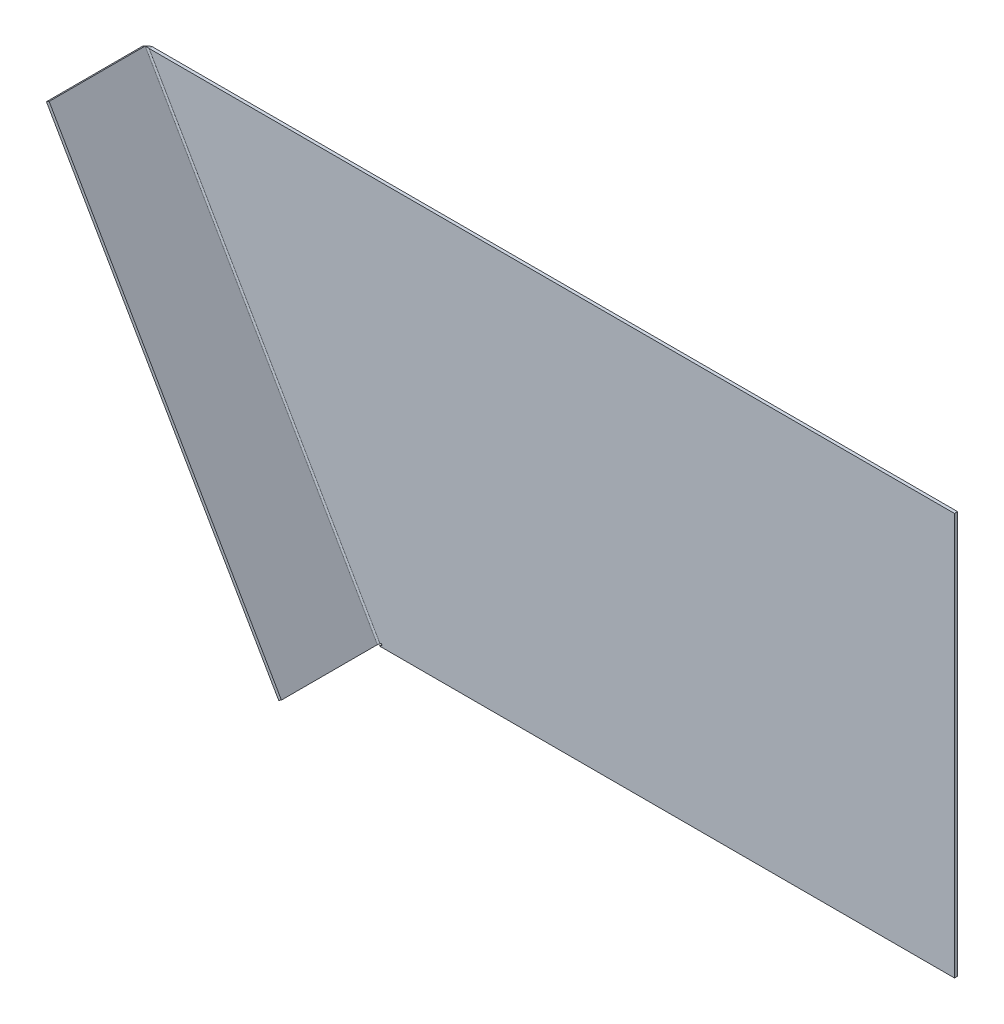
ISO-10303-21;
HEADER;
FILE_DESCRIPTION(('STEP AP214'),'2;1');
FILE_NAME('part.step','',(''),(''),'','','');
FILE_SCHEMA(('AUTOMOTIVE_DESIGN { 1 0 10303 214 1 1 1 1 }'));
ENDSEC;
DATA;
#1=APPLICATION_CONTEXT('core data for automotive mechanical design processes');
#2=APPLICATION_PROTOCOL_DEFINITION('international standard','automotive_design',2000,#1);
#3=PRODUCT_CONTEXT('',#1,'mechanical');
#4=PRODUCT('Part','Part','',(#3));
#5=PRODUCT_RELATED_PRODUCT_CATEGORY('part','',(#4));
#6=PRODUCT_DEFINITION_FORMATION('','',#4);
#7=PRODUCT_DEFINITION_CONTEXT('part definition',#1,'design');
#8=PRODUCT_DEFINITION('design','',#6,#7);
#9=PRODUCT_DEFINITION_SHAPE('','',#8);
#10=(LENGTH_UNIT() NAMED_UNIT(*) SI_UNIT(.MILLI.,.METRE.));
#11=(NAMED_UNIT(*) PLANE_ANGLE_UNIT() SI_UNIT($,.RADIAN.));
#12=(NAMED_UNIT(*) SI_UNIT($,.STERADIAN.) SOLID_ANGLE_UNIT());
#13=UNCERTAINTY_MEASURE_WITH_UNIT(LENGTH_MEASURE(1.E-05),#10,'distance_accuracy_value','');
#14=(GEOMETRIC_REPRESENTATION_CONTEXT(3) GLOBAL_UNCERTAINTY_ASSIGNED_CONTEXT((#13)) GLOBAL_UNIT_ASSIGNED_CONTEXT((#10,
#11,#12)) REPRESENTATION_CONTEXT('',''));
#15=CARTESIAN_POINT('',(0.,0.,0.));
#16=DIRECTION('',(0.,0.,1.));
#17=DIRECTION('',(1.,0.,0.));
#18=AXIS2_PLACEMENT_3D('',#15,#16,#17);
#19=CARTESIAN_POINT('',(0.,203.2,-1.5875));
#20=DIRECTION('',(0.,0.,1.));
#21=DIRECTION('',(1.,0.,0.));
#22=AXIS2_PLACEMENT_3D('',#19,#20,#21);
#23=PLANE('',#22);
#24=DIRECTION('',(-0.866025403784418,-0.500000000000035,0.));
#25=VECTOR('',#24,1.);
#26=CARTESIAN_POINT('',(15.3600560244928,176.595602558476,-1.5875));
#27=LINE('',#26,#25);
#28=CARTESIAN_POINT('',(-289.002987694811,0.871517335746149,-1.58749999999996));
#29=VERTEX_POINT('',#28);
#30=CARTESIAN_POINT('',(-290.5125,0.,-1.58749999999996));
#31=VERTEX_POINT('',#30);
#32=EDGE_CURVE('E72',#29,#31,#27,.T.);
#33=ORIENTED_EDGE('',*,*,#32,.F.);
#34=DIRECTION('',(0.500000000000017,-0.866025403784429,0.));
#35=VECTOR('',#34,1.);
#36=CARTESIAN_POINT('',(-304.363043719307,27.4759147772764,-1.58749999999996));
#37=LINE('',#36,#35);
#38=CARTESIAN_POINT('',(-289.399862694811,1.55892500000005,-1.58749999999996));
#39=VERTEX_POINT('',#38);
#40=EDGE_CURVE('E105',#39,#29,#37,.T.);
#41=ORIENTED_EDGE('',*,*,#40,.F.);
#42=DIRECTION('',(0.866025403784441,0.499999999999996,0.));
#43=VECTOR('',#42,1.);
#44=CARTESIAN_POINT('',(14.9631810244996,177.283010222716,-1.5875));
#45=LINE('',#44,#43);
#46=CARTESIAN_POINT('',(-290.087270359063,1.16205000000078,-1.58750000000075));
#47=VERTEX_POINT('',#46);
#48=EDGE_CURVE('E119',#47,#39,#45,.T.);
#49=ORIENTED_EDGE('',*,*,#48,.F.);
#50=DIRECTION('',(0.499999999999993,-0.866025403784442,0.));
#51=VECTOR('',#50,1.);
#52=CARTESIAN_POINT('',(-290.087270359063,1.16205000000082,-1.58750000000075));
#53=LINE('',#52,#51);
#54=CARTESIAN_POINT('',(-406.733935178083,203.200000000001,-1.5875));
#55=VERTEX_POINT('',#54);
#56=EDGE_CURVE('E275',#47,#55,#53,.F.);
#57=ORIENTED_EDGE('',*,*,#56,.T.);
#58=DIRECTION('',(-1.,0.,0.));
#59=VECTOR('',#58,1.);
#60=CARTESIAN_POINT('',(0.,203.2,-1.5875));
#61=LINE('',#60,#59);
#62=CARTESIAN_POINT('',(0.,203.2,-1.5875));
#63=VERTEX_POINT('',#62);
#64=EDGE_CURVE('E95',#63,#55,#61,.T.);
#65=ORIENTED_EDGE('',*,*,#64,.F.);
#66=DIRECTION('',(0.,-1.,0.));
#67=VECTOR('',#66,1.);
#68=CARTESIAN_POINT('',(0.,203.2,-1.5875));
#69=LINE('',#68,#67);
#70=CARTESIAN_POINT('',(0.,0.,-1.5875));
#71=VERTEX_POINT('',#70);
#72=EDGE_CURVE('E65',#63,#71,#69,.T.);
#73=ORIENTED_EDGE('',*,*,#72,.T.);
#74=DIRECTION('',(-1.,0.,0.));
#75=VECTOR('',#74,1.);
#76=CARTESIAN_POINT('',(0.,0.,-1.5875));
#77=LINE('',#76,#75);
#78=EDGE_CURVE('E92',#71,#31,#77,.T.);
#79=ORIENTED_EDGE('',*,*,#78,.T.);
#80=EDGE_LOOP('',(#33,#41,#49,#57,#65,#73,#79));
#81=FACE_BOUND('',#80,.T.);
#82=ADVANCED_FACE('F58',(#81),#23,.F.);
#83=CARTESIAN_POINT('',(0.,203.2,0.));
#84=DIRECTION('',(0.,0.,1.));
#85=DIRECTION('',(1.,0.,0.));
#86=AXIS2_PLACEMENT_3D('',#83,#84,#85);
#87=PLANE('',#86);
#88=DIRECTION('',(-0.500000000000017,0.866025403784429,0.));
#89=VECTOR('',#88,1.);
#90=CARTESIAN_POINT('',(-289.002987694811,0.871517335746138,-7.44725879205654E-13));
#91=LINE('',#90,#89);
#92=CARTESIAN_POINT('',(-289.002987694811,0.871517335746138,-7.44725879205654E-13));
#93=VERTEX_POINT('',#92);
#94=CARTESIAN_POINT('',(-289.399862694811,1.55892500000004,-7.44846892497542E-13));
#95=VERTEX_POINT('',#94);
#96=EDGE_CURVE('E125',#93,#95,#91,.T.);
#97=ORIENTED_EDGE('',*,*,#96,.F.);
#98=DIRECTION('',(0.866025403784418,0.500000000000035,-2.23834732691071E-13));
#99=VECTOR('',#98,1.);
#100=CARTESIAN_POINT('',(-290.5125,0.,-3.54574179440962E-13));
#101=LINE('',#100,#99);
#102=CARTESIAN_POINT('',(-290.5125,0.,-3.54574179440962E-13));
#103=VERTEX_POINT('',#102);
#104=EDGE_CURVE('E123',#103,#93,#101,.T.);
#105=ORIENTED_EDGE('',*,*,#104,.F.);
#106=DIRECTION('',(-1.,0.,0.));
#107=VECTOR('',#106,1.);
#108=CARTESIAN_POINT('',(0.,0.,0.));
#109=LINE('',#108,#107);
#110=CARTESIAN_POINT('',(0.,0.,0.));
#111=VERTEX_POINT('',#110);
#112=EDGE_CURVE('E104',#111,#103,#109,.T.);
#113=ORIENTED_EDGE('',*,*,#112,.F.);
#114=DIRECTION('',(0.,-1.,0.));
#115=VECTOR('',#114,1.);
#116=CARTESIAN_POINT('',(0.,203.2,0.));
#117=LINE('',#116,#115);
#118=CARTESIAN_POINT('',(0.,203.2,0.));
#119=VERTEX_POINT('',#118);
#120=EDGE_CURVE('E13',#119,#111,#117,.T.);
#121=ORIENTED_EDGE('',*,*,#120,.F.);
#122=DIRECTION('',(-1.,0.,0.));
#123=VECTOR('',#122,1.);
#124=CARTESIAN_POINT('',(0.,203.2,0.));
#125=LINE('',#124,#123);
#126=CARTESIAN_POINT('',(-406.733935178083,203.200000000001,-7.44792682388917E-13));
#127=VERTEX_POINT('',#126);
#128=EDGE_CURVE('E110',#119,#127,#125,.T.);
#129=ORIENTED_EDGE('',*,*,#128,.T.);
#130=DIRECTION('',(0.499999999999993,-0.866025403784442,0.));
#131=VECTOR('',#130,1.);
#132=CARTESIAN_POINT('',(-290.087270359065,1.16205000000006,-7.44846892497542E-13));
#133=LINE('',#132,#131);
#134=CARTESIAN_POINT('',(-290.087270359065,1.16205000000004,-7.44846892497542E-13));
#135=VERTEX_POINT('',#134);
#136=EDGE_CURVE('E148',#135,#127,#133,.F.);
#137=ORIENTED_EDGE('',*,*,#136,.F.);
#138=DIRECTION('',(-0.866025403784441,-0.499999999999996,0.));
#139=VECTOR('',#138,1.);
#140=CARTESIAN_POINT('',(-289.399862694811,1.55892500000004,-7.44846892497542E-13));
#141=LINE('',#140,#139);
#142=EDGE_CURVE('E128',#95,#135,#141,.T.);
#143=ORIENTED_EDGE('',*,*,#142,.F.);
#144=EDGE_LOOP('',(#97,#105,#113,#121,#129,#137,#143));
#145=FACE_BOUND('',#144,.T.);
#146=ADVANCED_FACE('F193',(#145),#87,.T.);
#147=CARTESIAN_POINT('',(0.,203.2,0.));
#148=DIRECTION('',(0.,-1.,0.));
#149=DIRECTION('',(-1.,0.,0.));
#150=AXIS2_PLACEMENT_3D('',#147,#148,#149);
#151=PLANE('',#150);
#152=DIRECTION('',(8.41999693620532E-13,4.86128749769388E-13,-1.));
#153=VECTOR('',#152,1.);
#154=CARTESIAN_POINT('',(-406.733935178083,203.200000000001,-7.44846892497542E-13));
#155=LINE('',#154,#153);
#156=EDGE_CURVE('E132',#127,#55,#155,.T.);
#157=ORIENTED_EDGE('',*,*,#156,.F.);
#158=ORIENTED_EDGE('',*,*,#128,.F.);
#159=DIRECTION('',(0.,0.,1.));
#160=VECTOR('',#159,1.);
#161=CARTESIAN_POINT('',(0.,203.2,-1.5875));
#162=LINE('',#161,#160);
#163=EDGE_CURVE('E97',#63,#119,#162,.T.);
#164=ORIENTED_EDGE('',*,*,#163,.F.);
#165=ORIENTED_EDGE('',*,*,#64,.T.);
#166=EDGE_LOOP('',(#157,#158,#164,#165));
#167=FACE_BOUND('',#166,.T.);
#168=ADVANCED_FACE('F197',(#167),#151,.F.);
#169=CARTESIAN_POINT('',(0.,0.,0.));
#170=DIRECTION('',(0.,-1.,0.));
#171=DIRECTION('',(-1.,0.,0.));
#172=AXIS2_PLACEMENT_3D('',#169,#170,#171);
#173=PLANE('',#172);
#174=ORIENTED_EDGE('',*,*,#112,.T.);
#175=DIRECTION('',(0.,0.,-1.));
#176=VECTOR('',#175,1.);
#177=CARTESIAN_POINT('',(-290.5125,0.,-3.54574179440962E-13));
#178=LINE('',#177,#176);
#179=EDGE_CURVE('E103',#103,#31,#178,.T.);
#180=ORIENTED_EDGE('',*,*,#179,.T.);
#181=ORIENTED_EDGE('',*,*,#78,.F.);
#182=DIRECTION('',(0.,0.,1.));
#183=VECTOR('',#182,1.);
#184=CARTESIAN_POINT('',(0.,0.,-1.5875));
#185=LINE('',#184,#183);
#186=EDGE_CURVE('E102',#71,#111,#185,.T.);
#187=ORIENTED_EDGE('',*,*,#186,.T.);
#188=EDGE_LOOP('',(#174,#180,#181,#187));
#189=FACE_BOUND('',#188,.T.);
#190=ADVANCED_FACE('F101',(#189),#173,.T.);
#191=CARTESIAN_POINT('',(0.,203.2,-1.5875));
#192=DIRECTION('',(1.,0.,0.));
#193=DIRECTION('',(0.,0.,-1.));
#194=AXIS2_PLACEMENT_3D('',#191,#192,#193);
#195=PLANE('',#194);
#196=ORIENTED_EDGE('',*,*,#186,.F.);
#197=ORIENTED_EDGE('',*,*,#72,.F.);
#198=ORIENTED_EDGE('',*,*,#163,.T.);
#199=ORIENTED_EDGE('',*,*,#120,.T.);
#200=EDGE_LOOP('',(#196,#197,#198,#199));
#201=FACE_BOUND('',#200,.T.);
#202=ADVANCED_FACE('F107',(#201),#195,.T.);
#203=CARTESIAN_POINT('',(-289.002987694811,0.871517335746138,-7.44725879205654E-13));
#204=DIRECTION('',(-0.866025403784429,-0.500000000000017,0.));
#205=DIRECTION('',(0.500000000000017,-0.866025403784429,0.));
#206=AXIS2_PLACEMENT_3D('',#203,#204,#205);
#207=PLANE('',#206);
#208=DIRECTION('',(0.,0.,-1.));
#209=VECTOR('',#208,1.);
#210=CARTESIAN_POINT('',(-289.399862694811,1.55892500000004,-7.44846892497542E-13));
#211=LINE('',#210,#209);
#212=EDGE_CURVE('E129',#95,#39,#211,.T.);
#213=ORIENTED_EDGE('',*,*,#212,.T.);
#214=ORIENTED_EDGE('',*,*,#40,.T.);
#215=DIRECTION('',(0.,0.,-1.));
#216=VECTOR('',#215,1.);
#217=CARTESIAN_POINT('',(-289.002987694811,0.871517335746138,-7.44725879205654E-13));
#218=LINE('',#217,#216);
#219=EDGE_CURVE('E126',#93,#29,#218,.T.);
#220=ORIENTED_EDGE('',*,*,#219,.F.);
#221=ORIENTED_EDGE('',*,*,#96,.T.);
#222=EDGE_LOOP('',(#213,#214,#220,#221));
#223=FACE_BOUND('',#222,.T.);
#224=ADVANCED_FACE('F208',(#223),#207,.T.);
#225=CARTESIAN_POINT('',(-289.399862694811,1.55892500000004,-7.44846892497542E-13));
#226=DIRECTION('',(0.499999999999996,-0.866025403784441,0.));
#227=DIRECTION('',(0.866025403784441,0.499999999999996,0.));
#228=AXIS2_PLACEMENT_3D('',#225,#226,#227);
#229=PLANE('',#228);
#230=DIRECTION('',(8.08857401698927E-13,4.66994038606888E-13,-1.));
#231=VECTOR('',#230,1.);
#232=CARTESIAN_POINT('',(-290.087270359065,1.16205000000004,-7.44846892497542E-13));
#233=LINE('',#232,#231);
#234=EDGE_CURVE('E238',#135,#47,#233,.T.);
#235=ORIENTED_EDGE('',*,*,#234,.T.);
#236=ORIENTED_EDGE('',*,*,#48,.T.);
#237=ORIENTED_EDGE('',*,*,#212,.F.);
#238=ORIENTED_EDGE('',*,*,#142,.T.);
#239=EDGE_LOOP('',(#235,#236,#237,#238));
#240=FACE_BOUND('',#239,.T.);
#241=ADVANCED_FACE('F214',(#240),#229,.T.);
#242=CARTESIAN_POINT('',(-290.5125,0.,-3.54574179440962E-13));
#243=DIRECTION('',(-0.500000000000035,0.866025403784418,0.));
#244=DIRECTION('',(-0.866025403784418,-0.500000000000035,0.));
#245=AXIS2_PLACEMENT_3D('',#242,#243,#244);
#246=PLANE('',#245);
#247=ORIENTED_EDGE('',*,*,#219,.T.);
#248=ORIENTED_EDGE('',*,*,#32,.T.);
#249=ORIENTED_EDGE('',*,*,#179,.F.);
#250=ORIENTED_EDGE('',*,*,#104,.T.);
#251=EDGE_LOOP('',(#247,#248,#249,#250));
#252=FACE_BOUND('',#251,.T.);
#253=ADVANCED_FACE('F211',(#252),#246,.T.);
#254=CARTESIAN_POINT('',(-406.733935178085,203.199999999999,-1.60337500000074));
#255=CARTESIAN_POINT('',(-407.055160786998,203.143677589455,-1.60337500000049));
#256=CARTESIAN_POINT('',(-407.376179766809,203.087433247148,-1.5424717140872));
#257=CARTESIAN_POINT('',(-407.978144485325,202.998122088203,-1.30803830408921));
#258=CARTESIAN_POINT('',(-408.258846243088,202.965175519463,-1.13460041954051));
#259=CARTESIAN_POINT('',(-408.745806373827,202.942262290229,-0.701423961073045));
#260=CARTESIAN_POINT('',(-408.951917144518,202.952380847955,-0.441855823593198));
#261=CARTESIAN_POINT('',(-409.266760746457,203.028839142956,0.124116494296507));
#262=CARTESIAN_POINT('',(-409.375404769555,203.095209539076,0.430249257063361));
#263=CARTESIAN_POINT('',(-409.431322852617,203.1920625,0.73659999999997));
#264=CARTESIAN_POINT('',(-406.733935178085,203.199999999999,-1.58750000000074));
#265=CARTESIAN_POINT('',(-407.053360757843,203.144716730962,-1.58750000000049));
#266=CARTESIAN_POINT('',(-407.372581216773,203.08951087098,-1.5270098978451));
#267=CARTESIAN_POINT('',(-407.971220654386,203.00211956386,-1.29416694517409));
#268=CARTESIAN_POINT('',(-408.250397360581,202.970053484053,-1.12190570841744));
#269=CARTESIAN_POINT('',(-408.734812431501,202.948609645791,-0.691668031893448));
#270=CARTESIAN_POINT('',(-408.939904195312,202.959316527413,-0.433860872279814));
#271=CARTESIAN_POINT('',(-409.253370420802,203.036570051077,0.128271741960709));
#272=CARTESIAN_POINT('',(-409.361656662087,203.103147118434,0.432327698792667));
#273=CARTESIAN_POINT('',(-409.417574699332,203.2,0.73659999999997));
#274=CARTESIAN_POINT('',(-406.733935178084,203.2,-7.44846892497542E-13));
#275=CARTESIAN_POINT('',(-406.873357842336,203.248630881658,-6.61275692962625E-13));
#276=CARTESIAN_POINT('',(-407.01272621315,203.29727325419,0.0191717263655383));
#277=CARTESIAN_POINT('',(-407.278837560444,203.401867129529,0.0929689463378204));
#278=CARTESIAN_POINT('',(-407.405509109875,203.457849943033,0.147565403889134));
#279=CARTESIAN_POINT('',(-407.635418198872,203.583345201945,0.283924886066228));
#280=CARTESIAN_POINT('',(-407.738609274761,203.652884473169,0.365634259058597));
#281=CARTESIAN_POINT('',(-407.914337855371,203.809660863183,0.543796508380848));
#282=CARTESIAN_POINT('',(-407.986845915298,203.896905054203,0.640171871723308));
#283=CARTESIAN_POINT('',(-408.042759370824,203.99375,0.736599999999976));
#284=CARTESIAN_POINT('',(-406.733935178084,203.2,0.0160337499992552));
#285=CARTESIAN_POINT('',(-406.87153981289,203.24968041458,0.016033749999337));
#286=CARTESIAN_POINT('',(-407.009091677613,203.299371654261,0.0347881607700657));
#287=CARTESIAN_POINT('',(-407.271844491195,203.405904579943,0.106979018842091));
#288=CARTESIAN_POINT('',(-407.396975738543,203.462776687269,0.16038706212343));
#289=CARTESIAN_POINT('',(-407.624314317123,203.589756031062,0.293778374537621));
#290=CARTESIAN_POINT('',(-407.726476196063,203.659889509421,0.373709159885115));
#291=CARTESIAN_POINT('',(-407.90081362646,203.817469080385,0.547993308521691));
#292=CARTESIAN_POINT('',(-407.972960326756,203.904922009355,0.642271097869908));
#293=CARTESIAN_POINT('',(-408.028873736006,204.001766875,0.736599999999976));
#294=B_SPLINE_SURFACE_WITH_KNOTS('',1,3,((#254,#255,#256,#257,#258,#259,#260,#261,#262,#263),
(#264,#265,#266,#267,#268,#269,#270,#271,#272,#273),(#274,#275,#276,#277,#278,#279,#280,#281,
#282,#283),(#284,#285,#286,#287,#288,#289,#290,#291,#292,#293)),.UNSPECIFIED.,.F.,.F.,.F.,(2,1,
1,2),(4,2,2,2,4),(-0.01,0.,1.,1.0101),(0.,0.25,0.5,0.75,1.),.UNSPECIFIED.);
#295=DIRECTION('',(0.86602540378444,0.499999999999998,0.));
#296=VECTOR('',#295,1.);
#297=CARTESIAN_POINT('',(-409.417574699331,203.2,0.736599999999971));
#298=LINE('',#297,#296);
#299=CARTESIAN_POINT('',(-408.042759370824,203.99375,0.736599999999976));
#300=VERTEX_POINT('',#299);
#301=CARTESIAN_POINT('',(-409.417574699331,203.2,0.73659999999997));
#302=VERTEX_POINT('',#301);
#303=EDGE_CURVE('E272',#300,#302,#298,.F.);
#304=CARTESIAN_POINT('',(-406.733935178084,203.2,-7.44846892497542E-13));
#305=CARTESIAN_POINT('',(-406.779950355948,203.216051768068,-1.20620819126919E-05));
#306=CARTESIAN_POINT('',(-406.825962929327,203.232101745282,0.00206203282202842));
#307=CARTESIAN_POINT('',(-406.917522210535,203.264464705255,0.0102944682398531));
#308=CARTESIAN_POINT('',(-406.96306897119,203.280777657638,0.0164523402955853));
#309=CARTESIAN_POINT('',(-407.053083179884,203.313876573826,0.0327347142828491));
#310=CARTESIAN_POINT('',(-407.097553943701,203.330660607194,0.0428447467124444));
#311=CARTESIAN_POINT('',(-407.185141128822,203.364998440555,0.0668507162235848));
#312=CARTESIAN_POINT('',(-407.228257590413,203.382552217614,0.0807465405664543));
#313=CARTESIAN_POINT('',(-407.355326307256,203.436893958266,0.127932147308252));
#314=CARTESIAN_POINT('',(-407.436670113296,203.47524759329,0.166659125037459));
#315=CARTESIAN_POINT('',(-407.589253679417,203.557794559769,0.255989917751154));
#316=CARTESIAN_POINT('',(-407.660492573263,203.601988391244,0.306594749966843));
#317=CARTESIAN_POINT('',(-407.758937173654,203.674254740512,0.389551810225545));
#318=CARTESIAN_POINT('',(-407.790728367214,203.699736270814,0.418836509135844));
#319=CARTESIAN_POINT('',(-407.850838826576,203.752718101012,0.479119589976424));
#320=CARTESIAN_POINT('',(-407.87915786565,203.780218532552,0.510118083623349));
#321=CARTESIAN_POINT('',(-407.932242219039,203.837440106413,0.573398512480383));
#322=CARTESIAN_POINT('',(-407.956993025624,203.867169606668,0.605685041510468));
#323=CARTESIAN_POINT('',(-408.002725347162,203.928810375527,0.670847076336169));
#324=CARTESIAN_POINT('',(-408.023706477032,203.960721866568,0.703722641926538));
#325=CARTESIAN_POINT('',(-408.042759370824,203.99375,0.736599999999976));
#326=B_SPLINE_CURVE_WITH_KNOTS('',3,(#304,#305,#306,#307,#308,#309,#310,#311,#312,#313,#314,
#315,#316,#317,#318,#319,#320,#321,#322,#323,#324,#325),.UNSPECIFIED.,.F.,.F.,(4,2,2,2,2,2,2,2,
2,2,4),(0.,0.146154486814233,0.292292210857646,0.437899837716808,0.583503128939626,
0.875753899910738,1.16802970866484,1.31839529007632,1.46877068490931,1.61974120375091,
1.77072713585112),.UNSPECIFIED.);
#327=EDGE_CURVE('E139',#127,#300,#326,.T.);
#328=CARTESIAN_POINT('',(-406.733935178085,203.199999999999,-1.58750000000074));
#329=CARTESIAN_POINT('',(-406.800743737861,203.188438728209,-1.58750081267307));
#330=CARTESIAN_POINT('',(-406.867527051428,203.176881101307,-1.58488494414637));
#331=CARTESIAN_POINT('',(-407.000715441418,203.153980376642,-1.57444916273615));
#332=CARTESIAN_POINT('',(-407.0671205573,203.1426372562,-1.56662980317947));
#333=CARTESIAN_POINT('',(-407.265196965277,203.109253831985,-1.53542560375361));
#334=CARTESIAN_POINT('',(-407.39583292267,203.087841074411,-1.50429454907179));
#335=CARTESIAN_POINT('',(-407.663309749968,203.04653926441,-1.41831193683393));
#336=CARTESIAN_POINT('',(-407.799569939282,203.026985553896,-1.36149638207346));
#337=CARTESIAN_POINT('',(-408.061498775213,202.993981564598,-1.22593479742267));
#338=CARTESIAN_POINT('',(-408.187168316412,202.980530769883,-1.1471906222503));
#339=CARTESIAN_POINT('',(-408.424697011456,202.961608039581,-0.970315529126827));
#340=CARTESIAN_POINT('',(-408.536556707066,202.956135790901,-0.87218537209007));
#341=CARTESIAN_POINT('',(-408.743722486122,202.954761083269,-0.659655068917461));
#342=CARTESIAN_POINT('',(-408.839023387016,202.958861614618,-0.545249849335332));
#343=CARTESIAN_POINT('',(-409.010812749436,202.977946004141,-0.303864199472295));
#344=CARTESIAN_POINT('',(-409.087293698265,202.992934199134,-0.176878775605333));
#345=CARTESIAN_POINT('',(-409.219698368275,203.034741738043,0.0854873652663903));
#346=CARTESIAN_POINT('',(-409.275644854693,203.06154790709,0.220858589609468));
#347=CARTESIAN_POINT('',(-409.341448481761,203.109524529636,0.420714632006021));
#348=CARTESIAN_POINT('',(-409.35982139892,203.125827506876,0.483699153655391));
#349=CARTESIAN_POINT('',(-409.392060737075,203.160988708677,0.609979755719965));
#350=CARTESIAN_POINT('',(-409.405935060962,203.179842368813,0.673275089282185));
#351=CARTESIAN_POINT('',(-409.417574699332,203.2,0.73659999999997));
#352=B_SPLINE_CURVE_WITH_KNOTS('',3,(#328,#329,#330,#331,#332,#333,#334,#335,#336,#337,#338,
#339,#340,#341,#342,#343,#344,#345,#346,#347,#348,#349,#350,#351),.UNSPECIFIED.,.F.,.F.,(4,2,2,
2,2,2,2,2,2,2,2,4),(0.,0.203303503959263,0.40658539256198,0.812836886622702,1.25748866275538,
1.70210284175395,2.14669957277803,2.591435203462,3.03634808026109,3.48076621021634,
3.68341341554135,3.88570266741171),.UNSPECIFIED.);
#353=EDGE_CURVE('E149',#55,#302,#352,.T.);
#354=ORIENTED_EDGE('',*,*,#303,.F.);
#355=ORIENTED_EDGE('',*,*,#327,.F.);
#356=ORIENTED_EDGE('',*,*,#156,.T.);
#357=ORIENTED_EDGE('',*,*,#353,.T.);
#358=EDGE_LOOP('',(#354,#355,#356,#357));
#359=FACE_BOUND('',#358,.T.);
#360=ADVANCED_FACE('F155',(#359),#294,.F.);
#361=CARTESIAN_POINT('',(-290.087270359065,1.16204999999968,0.736599999999978));
#362=DIRECTION('',(-0.499999999999993,0.866025403784442,0.));
#363=DIRECTION('',(-0.866025403784443,-0.499999999999993,0.));
#364=AXIS2_PLACEMENT_3D('',#361,#362,#363);
#365=PLANE('',#364);
#366=CARTESIAN_POINT('',(-290.087270359065,1.16204999999968,0.736599999999978));
#367=DIRECTION('',(0.499999999999993,-0.866025403784442,0.));
#368=DIRECTION('',(0.866025403784443,0.499999999999993,0.));
#369=AXIS2_PLACEMENT_3D('',#366,#367,#368);
#370=CIRCLE('',#369,0.736600000000723);
#371=CARTESIAN_POINT('',(-290.725184671493,0.793749999999323,0.736599999999976));
#372=VERTEX_POINT('',#371);
#373=EDGE_CURVE('E231',#372,#135,#370,.T.);
#374=ORIENTED_EDGE('',*,*,#373,.F.);
#375=DIRECTION('',(0.86602540378444,0.499999999999998,0.));
#376=VECTOR('',#375,1.);
#377=CARTESIAN_POINT('',(-290.725184671492,0.793750000000065,0.736599999999976));
#378=LINE('',#377,#376);
#379=CARTESIAN_POINT('',(-292.1,0.,0.736599999999971));
#380=VERTEX_POINT('',#379);
#381=EDGE_CURVE('E235',#372,#380,#378,.F.);
#382=ORIENTED_EDGE('',*,*,#381,.T.);
#383=CARTESIAN_POINT('',(-290.087270359065,1.1620499999997,0.736599999999978));
#384=DIRECTION('',(0.499999999999993,-0.866025403784442,0.));
#385=DIRECTION('',(0.866025403784443,0.499999999999993,0.));
#386=AXIS2_PLACEMENT_3D('',#383,#384,#385);
#387=CIRCLE('',#386,2.32410000000072);
#388=EDGE_CURVE('E147',#380,#47,#387,.T.);
#389=ORIENTED_EDGE('',*,*,#388,.T.);
#390=ORIENTED_EDGE('',*,*,#234,.F.);
#391=EDGE_LOOP('',(#374,#382,#389,#390));
#392=FACE_BOUND('',#391,.T.);
#393=ADVANCED_FACE('F169',(#392),#365,.F.);
#394=CARTESIAN_POINT('',(-290.087270359065,1.16204999999972,0.736599999999978));
#395=DIRECTION('',(0.499999999999993,-0.866025403784442,0.));
#396=DIRECTION('',(-0.866025403784443,-0.499999999999993,0.));
#397=AXIS2_PLACEMENT_3D('',#394,#395,#396);
#398=CYLINDRICAL_SURFACE('',#397,2.32410000000072);
#399=ORIENTED_EDGE('',*,*,#56,.F.);
#400=ORIENTED_EDGE('',*,*,#388,.F.);
#401=DIRECTION('',(0.499999999999998,-0.86602540378444,0.));
#402=VECTOR('',#401,1.);
#403=CARTESIAN_POINT('',(-409.417574699331,203.2,0.736599999999971));
#404=LINE('',#403,#402);
#405=EDGE_CURVE('E255',#380,#302,#404,.F.);
#406=ORIENTED_EDGE('',*,*,#405,.T.);
#407=ORIENTED_EDGE('',*,*,#353,.F.);
#408=EDGE_LOOP('',(#399,#400,#406,#407));
#409=FACE_BOUND('',#408,.T.);
#410=ADVANCED_FACE('F164',(#409),#398,.T.);
#411=CARTESIAN_POINT('',(-290.087270359065,1.16204999999972,0.736599999999978));
#412=DIRECTION('',(0.499999999999993,-0.866025403784442,0.));
#413=DIRECTION('',(-0.866025403784443,-0.499999999999993,0.));
#414=AXIS2_PLACEMENT_3D('',#411,#412,#413);
#415=CYLINDRICAL_SURFACE('',#414,0.736600000000723);
#416=ORIENTED_EDGE('',*,*,#136,.T.);
#417=ORIENTED_EDGE('',*,*,#327,.T.);
#418=DIRECTION('',(0.499999999999998,-0.86602540378444,0.));
#419=VECTOR('',#418,1.);
#420=CARTESIAN_POINT('',(-408.042759370824,203.99375,0.736599999999976));
#421=LINE('',#420,#419);
#422=EDGE_CURVE('E256',#300,#372,#421,.T.);
#423=ORIENTED_EDGE('',*,*,#422,.T.);
#424=ORIENTED_EDGE('',*,*,#373,.T.);
#425=EDGE_LOOP('',(#416,#417,#423,#424));
#426=FACE_BOUND('',#425,.T.);
#427=ADVANCED_FACE('F160',(#426),#415,.F.);
#428=CARTESIAN_POINT('',(-292.1,0.,49.2125));
#429=DIRECTION('',(-0.499999999999998,0.86602540378444,0.));
#430=DIRECTION('',(-0.86602540378444,-0.499999999999998,0.));
#431=AXIS2_PLACEMENT_3D('',#428,#429,#430);
#432=PLANE('',#431);
#433=ORIENTED_EDGE('',*,*,#381,.F.);
#434=DIRECTION('',(0.,0.,-1.));
#435=VECTOR('',#434,1.);
#436=CARTESIAN_POINT('',(-290.725184671492,0.793749999999896,49.2125));
#437=LINE('',#436,#435);
#438=CARTESIAN_POINT('',(-290.725184671492,0.793749999999893,49.2125));
#439=VERTEX_POINT('',#438);
#440=EDGE_CURVE('E251',#372,#439,#437,.F.);
#441=ORIENTED_EDGE('',*,*,#440,.T.);
#442=DIRECTION('',(0.86602540378444,0.499999999999998,0.));
#443=VECTOR('',#442,1.);
#444=CARTESIAN_POINT('',(-292.1,0.,49.2125));
#445=LINE('',#444,#443);
#446=CARTESIAN_POINT('',(-292.1,0.,49.2125));
#447=VERTEX_POINT('',#446);
#448=EDGE_CURVE('E244',#447,#439,#445,.T.);
#449=ORIENTED_EDGE('',*,*,#448,.F.);
#450=DIRECTION('',(0.,0.,1.));
#451=VECTOR('',#450,1.);
#452=CARTESIAN_POINT('',(-292.1,0.,-6.64513812209377E-13));
#453=LINE('',#452,#451);
#454=EDGE_CURVE('E254',#380,#447,#453,.T.);
#455=ORIENTED_EDGE('',*,*,#454,.F.);
#456=EDGE_LOOP('',(#433,#441,#449,#455));
#457=FACE_BOUND('',#456,.T.);
#458=ADVANCED_FACE('F163',(#457),#432,.F.);
#459=CARTESIAN_POINT('',(-409.417574699331,203.2,0.));
#460=DIRECTION('',(0.499999999999998,-0.86602540378444,0.));
#461=DIRECTION('',(0.86602540378444,0.499999999999998,0.));
#462=AXIS2_PLACEMENT_3D('',#459,#460,#461);
#463=PLANE('',#462);
#464=ORIENTED_EDGE('',*,*,#303,.T.);
#465=DIRECTION('',(0.,0.,-1.));
#466=VECTOR('',#465,1.);
#467=CARTESIAN_POINT('',(-409.417574699331,203.2,-9.13979447875789E-13));
#468=LINE('',#467,#466);
#469=CARTESIAN_POINT('',(-409.417574699332,203.2,49.2125));
#470=VERTEX_POINT('',#469);
#471=EDGE_CURVE('E298',#470,#302,#468,.T.);
#472=ORIENTED_EDGE('',*,*,#471,.F.);
#473=DIRECTION('',(0.86602540378444,0.499999999999998,0.));
#474=VECTOR('',#473,1.);
#475=CARTESIAN_POINT('',(-409.417574699332,203.2,49.2125));
#476=LINE('',#475,#474);
#477=CARTESIAN_POINT('',(-408.042759370824,203.99375,49.2125));
#478=VERTEX_POINT('',#477);
#479=EDGE_CURVE('E328',#470,#478,#476,.T.);
#480=ORIENTED_EDGE('',*,*,#479,.T.);
#481=DIRECTION('',(0.,0.,1.));
#482=VECTOR('',#481,1.);
#483=CARTESIAN_POINT('',(-408.042759370824,203.99375,0.));
#484=LINE('',#483,#482);
#485=EDGE_CURVE('E265',#478,#300,#484,.F.);
#486=ORIENTED_EDGE('',*,*,#485,.T.);
#487=EDGE_LOOP('',(#464,#472,#480,#486));
#488=FACE_BOUND('',#487,.T.);
#489=ADVANCED_FACE('F173',(#488),#463,.F.);
#490=CARTESIAN_POINT('',(-219.075000000001,-126.483010222717,-8.56449603610338E-13));
#491=DIRECTION('',(0.86602540378444,0.499999999999998,0.));
#492=DIRECTION('',(-0.499999999999998,0.86602540378444,0.));
#493=AXIS2_PLACEMENT_3D('',#490,#491,#492);
#494=PLANE('',#493);
#495=ORIENTED_EDGE('',*,*,#405,.F.);
#496=ORIENTED_EDGE('',*,*,#454,.T.);
#497=DIRECTION('',(-0.499999999999998,0.86602540378444,0.));
#498=VECTOR('',#497,1.);
#499=CARTESIAN_POINT('',(-219.075000000001,-126.483010222717,49.2125000000001));
#500=LINE('',#499,#498);
#501=EDGE_CURVE('E324',#447,#470,#500,.T.);
#502=ORIENTED_EDGE('',*,*,#501,.T.);
#503=ORIENTED_EDGE('',*,*,#471,.T.);
#504=EDGE_LOOP('',(#495,#496,#502,#503));
#505=FACE_BOUND('',#504,.T.);
#506=ADVANCED_FACE('F182',(#505),#494,.F.);
#507=CARTESIAN_POINT('',(-217.700184671493,-125.689260222717,-8.51075243304072E-13));
#508=DIRECTION('',(0.86602540378444,0.499999999999998,0.));
#509=DIRECTION('',(-0.499999999999998,0.86602540378444,0.));
#510=AXIS2_PLACEMENT_3D('',#507,#508,#509);
#511=PLANE('',#510);
#512=ORIENTED_EDGE('',*,*,#440,.F.);
#513=ORIENTED_EDGE('',*,*,#422,.F.);
#514=ORIENTED_EDGE('',*,*,#485,.F.);
#515=DIRECTION('',(0.499999999999998,-0.86602540378444,0.));
#516=VECTOR('',#515,1.);
#517=CARTESIAN_POINT('',(-408.042759370824,203.99375,49.2125));
#518=LINE('',#517,#516);
#519=EDGE_CURVE('E263',#439,#478,#518,.F.);
#520=ORIENTED_EDGE('',*,*,#519,.F.);
#521=EDGE_LOOP('',(#512,#513,#514,#520));
#522=FACE_BOUND('',#521,.T.);
#523=ADVANCED_FACE('F178',(#522),#511,.T.);
#524=CARTESIAN_POINT('',(-409.417574699332,203.2,49.2125));
#525=DIRECTION('',(0.,0.,-1.));
#526=DIRECTION('',(-1.,0.,0.));
#527=AXIS2_PLACEMENT_3D('',#524,#525,#526);
#528=PLANE('',#527);
#529=ORIENTED_EDGE('',*,*,#519,.T.);
#530=ORIENTED_EDGE('',*,*,#479,.F.);
#531=ORIENTED_EDGE('',*,*,#501,.F.);
#532=ORIENTED_EDGE('',*,*,#448,.T.);
#533=EDGE_LOOP('',(#529,#530,#531,#532));
#534=FACE_BOUND('',#533,.T.);
#535=ADVANCED_FACE('F175',(#534),#528,.F.);
#536=CLOSED_SHELL('',(#82,#146,#168,#190,#202,#224,#241,#253,#360,#393,#410,#427,#458,#489,#506,
#523,#535));
#537=MANIFOLD_SOLID_BREP('B2',#536);
#538=ADVANCED_BREP_SHAPE_REPRESENTATION('',(#18,#537),#14);
#539=SHAPE_DEFINITION_REPRESENTATION(#9,#538);
ENDSEC;
END-ISO-10303-21;
